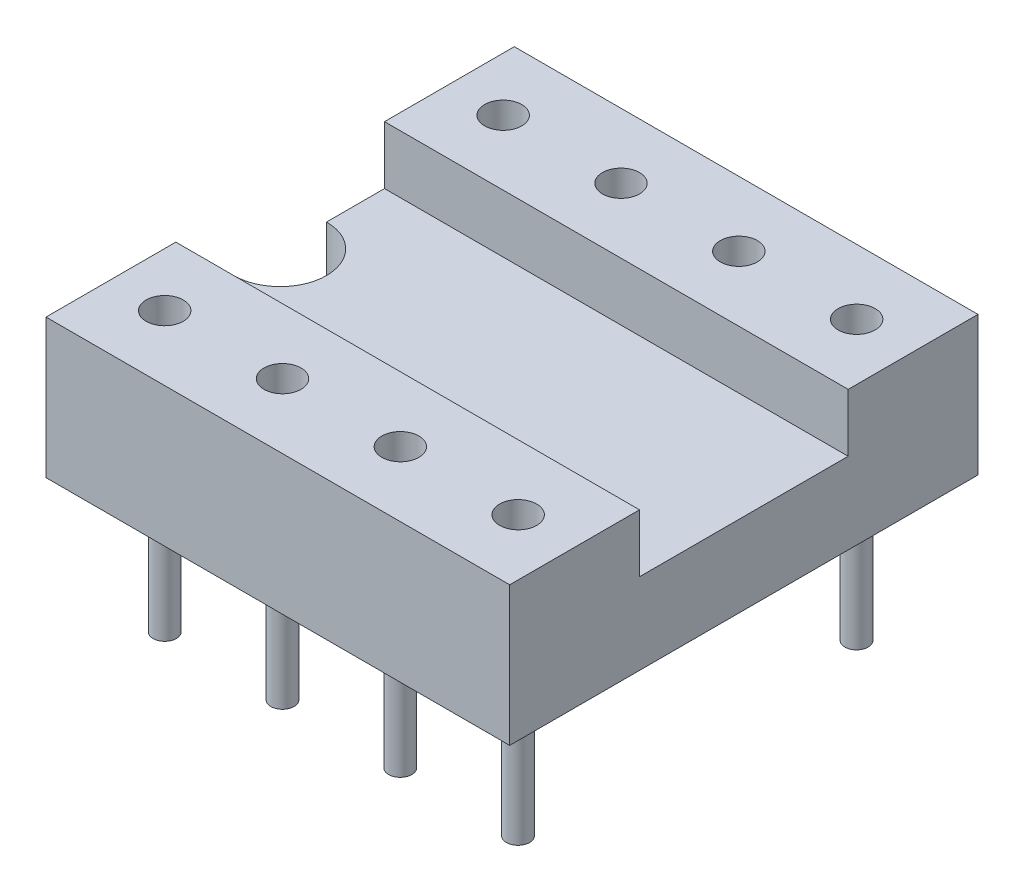
ISO-10303-21;
HEADER;
FILE_DESCRIPTION(('STEP AP214'),'2;1');
FILE_NAME('part.step','',(''),(''),'','','');
FILE_SCHEMA(('AUTOMOTIVE_DESIGN { 1 0 10303 214 1 1 1 1 }'));
ENDSEC;
DATA;
#1=APPLICATION_CONTEXT('core data for automotive mechanical design processes');
#2=APPLICATION_PROTOCOL_DEFINITION('international standard','automotive_design',2000,#1);
#3=PRODUCT_CONTEXT('',#1,'mechanical');
#4=PRODUCT('Part','Part','',(#3));
#5=PRODUCT_RELATED_PRODUCT_CATEGORY('part','',(#4));
#6=PRODUCT_DEFINITION_FORMATION('','',#4);
#7=PRODUCT_DEFINITION_CONTEXT('part definition',#1,'design');
#8=PRODUCT_DEFINITION('design','',#6,#7);
#9=PRODUCT_DEFINITION_SHAPE('','',#8);
#10=(LENGTH_UNIT() NAMED_UNIT(*) SI_UNIT(.MILLI.,.METRE.));
#11=(NAMED_UNIT(*) PLANE_ANGLE_UNIT() SI_UNIT($,.RADIAN.));
#12=(NAMED_UNIT(*) SI_UNIT($,.STERADIAN.) SOLID_ANGLE_UNIT());
#13=UNCERTAINTY_MEASURE_WITH_UNIT(LENGTH_MEASURE(1.E-05),#10,'distance_accuracy_value','');
#14=(GEOMETRIC_REPRESENTATION_CONTEXT(3) GLOBAL_UNCERTAINTY_ASSIGNED_CONTEXT((#13)) GLOBAL_UNIT_ASSIGNED_CONTEXT((#10,
#11,#12)) REPRESENTATION_CONTEXT('',''));
#15=CARTESIAN_POINT('',(0.,0.,0.));
#16=DIRECTION('',(0.,0.,1.));
#17=DIRECTION('',(1.,0.,0.));
#18=AXIS2_PLACEMENT_3D('',#15,#16,#17);
#19=CARTESIAN_POINT('',(10.,0.,5.05));
#20=DIRECTION('',(0.,1.,0.));
#21=DIRECTION('',(0.,0.,1.));
#22=AXIS2_PLACEMENT_3D('',#19,#20,#21);
#23=PLANE('',#22);
#24=CARTESIAN_POINT('',(8.78,0.,3.65));
#25=DIRECTION('',(0.,1.,0.));
#26=DIRECTION('',(0.,0.,1.));
#27=AXIS2_PLACEMENT_3D('',#24,#25,#26);
#28=CIRCLE('',#27,0.25);
#29=CARTESIAN_POINT('',(8.78,0.,3.9));
#30=VERTEX_POINT('',#29);
#31=EDGE_CURVE('E36',#30,#30,#28,.F.);
#32=ORIENTED_EDGE('',*,*,#31,.F.);
#33=EDGE_LOOP('',(#32));
#34=FACE_BOUND('',#33,.T.);
#35=CARTESIAN_POINT('',(6.24,0.,3.65));
#36=DIRECTION('',(0.,1.,0.));
#37=DIRECTION('',(0.,0.,1.));
#38=AXIS2_PLACEMENT_3D('',#35,#36,#37);
#39=CIRCLE('',#38,0.25);
#40=CARTESIAN_POINT('',(6.24,0.,3.9));
#41=VERTEX_POINT('',#40);
#42=EDGE_CURVE('E194',#41,#41,#39,.F.);
#43=ORIENTED_EDGE('',*,*,#42,.F.);
#44=EDGE_LOOP('',(#43));
#45=FACE_BOUND('',#44,.T.);
#46=CARTESIAN_POINT('',(3.7,0.,3.65));
#47=DIRECTION('',(0.,1.,0.));
#48=DIRECTION('',(0.,0.,1.));
#49=AXIS2_PLACEMENT_3D('',#46,#47,#48);
#50=CIRCLE('',#49,0.25);
#51=CARTESIAN_POINT('',(3.7,0.,3.9));
#52=VERTEX_POINT('',#51);
#53=EDGE_CURVE('E188',#52,#52,#50,.F.);
#54=ORIENTED_EDGE('',*,*,#53,.F.);
#55=EDGE_LOOP('',(#54));
#56=FACE_BOUND('',#55,.T.);
#57=CARTESIAN_POINT('',(1.16,0.,3.65));
#58=DIRECTION('',(0.,1.,0.));
#59=DIRECTION('',(0.,0.,1.));
#60=AXIS2_PLACEMENT_3D('',#57,#58,#59);
#61=CIRCLE('',#60,0.25);
#62=CARTESIAN_POINT('',(1.16,0.,3.9));
#63=VERTEX_POINT('',#62);
#64=EDGE_CURVE('E182',#63,#63,#61,.F.);
#65=ORIENTED_EDGE('',*,*,#64,.F.);
#66=EDGE_LOOP('',(#65));
#67=FACE_BOUND('',#66,.T.);
#68=DIRECTION('',(0.,0.,-1.));
#69=VECTOR('',#68,1.);
#70=CARTESIAN_POINT('',(0.,0.,5.05));
#71=LINE('',#70,#69);
#72=CARTESIAN_POINT('',(0.,0.,5.05));
#73=VERTEX_POINT('',#72);
#74=CARTESIAN_POINT('',(0.,0.,1.));
#75=VERTEX_POINT('',#74);
#76=EDGE_CURVE('E136',#73,#75,#71,.T.);
#77=ORIENTED_EDGE('',*,*,#76,.T.);
#78=CARTESIAN_POINT('',(0.,0.,0.));
#79=DIRECTION('',(0.,1.,0.));
#80=DIRECTION('',(0.,0.,1.));
#81=AXIS2_PLACEMENT_3D('',#78,#79,#80);
#82=CIRCLE('',#81,1.);
#83=CARTESIAN_POINT('',(0.,0.,-1.));
#84=VERTEX_POINT('',#83);
#85=EDGE_CURVE('E43',#75,#84,#82,.T.);
#86=ORIENTED_EDGE('',*,*,#85,.T.);
#87=CARTESIAN_POINT('',(0.,0.,-5.05));
#88=VERTEX_POINT('',#87);
#89=EDGE_CURVE('E121',#84,#88,#71,.T.);
#90=ORIENTED_EDGE('',*,*,#89,.T.);
#91=DIRECTION('',(-1.,0.,0.));
#92=VECTOR('',#91,1.);
#93=CARTESIAN_POINT('',(10.,0.,-5.05));
#94=LINE('',#93,#92);
#95=CARTESIAN_POINT('',(10.,0.,-5.05));
#96=VERTEX_POINT('',#95);
#97=EDGE_CURVE('E167',#96,#88,#94,.T.);
#98=ORIENTED_EDGE('',*,*,#97,.F.);
#99=DIRECTION('',(0.,0.,-1.));
#100=VECTOR('',#99,1.);
#101=CARTESIAN_POINT('',(10.,0.,5.05));
#102=LINE('',#101,#100);
#103=CARTESIAN_POINT('',(10.,0.,5.05));
#104=VERTEX_POINT('',#103);
#105=EDGE_CURVE('E153',#104,#96,#102,.T.);
#106=ORIENTED_EDGE('',*,*,#105,.F.);
#107=DIRECTION('',(-1.,0.,0.));
#108=VECTOR('',#107,1.);
#109=CARTESIAN_POINT('',(10.,0.,5.05));
#110=LINE('',#109,#108);
#111=EDGE_CURVE('E170',#104,#73,#110,.T.);
#112=ORIENTED_EDGE('',*,*,#111,.T.);
#113=EDGE_LOOP('',(#77,#86,#90,#98,#106,#112));
#114=FACE_BOUND('',#113,.T.);
#115=CARTESIAN_POINT('',(1.16,0.,-3.65));
#116=DIRECTION('',(0.,1.,0.));
#117=DIRECTION('',(0.,0.,1.));
#118=AXIS2_PLACEMENT_3D('',#115,#116,#117);
#119=CIRCLE('',#118,0.25);
#120=CARTESIAN_POINT('',(1.16,0.,-3.4));
#121=VERTEX_POINT('',#120);
#122=EDGE_CURVE('E185',#121,#121,#119,.F.);
#123=ORIENTED_EDGE('',*,*,#122,.F.);
#124=EDGE_LOOP('',(#123));
#125=FACE_BOUND('',#124,.T.);
#126=CARTESIAN_POINT('',(3.7,0.,-3.65));
#127=DIRECTION('',(0.,1.,0.));
#128=DIRECTION('',(0.,0.,1.));
#129=AXIS2_PLACEMENT_3D('',#126,#127,#128);
#130=CIRCLE('',#129,0.25);
#131=CARTESIAN_POINT('',(3.7,0.,-3.4));
#132=VERTEX_POINT('',#131);
#133=EDGE_CURVE('E191',#132,#132,#130,.F.);
#134=ORIENTED_EDGE('',*,*,#133,.F.);
#135=EDGE_LOOP('',(#134));
#136=FACE_BOUND('',#135,.T.);
#137=CARTESIAN_POINT('',(6.24,0.,-3.65));
#138=DIRECTION('',(0.,1.,0.));
#139=DIRECTION('',(0.,0.,1.));
#140=AXIS2_PLACEMENT_3D('',#137,#138,#139);
#141=CIRCLE('',#140,0.25);
#142=CARTESIAN_POINT('',(6.24,0.,-3.4));
#143=VERTEX_POINT('',#142);
#144=EDGE_CURVE('E197',#143,#143,#141,.F.);
#145=ORIENTED_EDGE('',*,*,#144,.F.);
#146=EDGE_LOOP('',(#145));
#147=FACE_BOUND('',#146,.T.);
#148=CARTESIAN_POINT('',(8.78,0.,-3.65));
#149=DIRECTION('',(0.,1.,0.));
#150=DIRECTION('',(0.,0.,1.));
#151=AXIS2_PLACEMENT_3D('',#148,#149,#150);
#152=CIRCLE('',#151,0.25);
#153=CARTESIAN_POINT('',(8.78,0.,-3.4));
#154=VERTEX_POINT('',#153);
#155=EDGE_CURVE('E11',#154,#154,#152,.F.);
#156=ORIENTED_EDGE('',*,*,#155,.F.);
#157=EDGE_LOOP('',(#156));
#158=FACE_BOUND('',#157,.T.);
#159=ADVANCED_FACE('F28',(#34,#45,#56,#67,#114,#125,#136,#147,#158),#23,.F.);
#160=CARTESIAN_POINT('',(0.,1.75,5.05));
#161=DIRECTION('',(1.,0.,0.));
#162=DIRECTION('',(0.,0.,-1.));
#163=AXIS2_PLACEMENT_3D('',#160,#161,#162);
#164=PLANE('',#163);
#165=ORIENTED_EDGE('',*,*,#89,.F.);
#166=DIRECTION('',(0.,1.,0.));
#167=VECTOR('',#166,1.);
#168=CARTESIAN_POINT('',(0.,0.,-1.));
#169=LINE('',#168,#167);
#170=CARTESIAN_POINT('',(0.,1.75,-1.));
#171=VERTEX_POINT('',#170);
#172=EDGE_CURVE('E107',#84,#171,#169,.T.);
#173=ORIENTED_EDGE('',*,*,#172,.T.);
#174=DIRECTION('',(0.,0.,1.));
#175=VECTOR('',#174,1.);
#176=CARTESIAN_POINT('',(0.,1.75,-2.25));
#177=LINE('',#176,#175);
#178=CARTESIAN_POINT('',(0.,1.75,-2.25));
#179=VERTEX_POINT('',#178);
#180=EDGE_CURVE('E119',#179,#171,#177,.T.);
#181=ORIENTED_EDGE('',*,*,#180,.F.);
#182=DIRECTION('',(0.,-1.,0.));
#183=VECTOR('',#182,1.);
#184=CARTESIAN_POINT('',(0.,3.,-2.25));
#185=LINE('',#184,#183);
#186=CARTESIAN_POINT('',(0.,3.,-2.25));
#187=VERTEX_POINT('',#186);
#188=EDGE_CURVE('E143',#187,#179,#185,.T.);
#189=ORIENTED_EDGE('',*,*,#188,.F.);
#190=DIRECTION('',(0.,0.,1.));
#191=VECTOR('',#190,1.);
#192=CARTESIAN_POINT('',(0.,3.,-5.05));
#193=LINE('',#192,#191);
#194=CARTESIAN_POINT('',(0.,3.,-5.05));
#195=VERTEX_POINT('',#194);
#196=EDGE_CURVE('E141',#195,#187,#193,.T.);
#197=ORIENTED_EDGE('',*,*,#196,.F.);
#198=DIRECTION('',(0.,1.,0.));
#199=VECTOR('',#198,1.);
#200=CARTESIAN_POINT('',(0.,0.,-5.05));
#201=LINE('',#200,#199);
#202=EDGE_CURVE('E139',#88,#195,#201,.T.);
#203=ORIENTED_EDGE('',*,*,#202,.F.);
#204=EDGE_LOOP('',(#165,#173,#181,#189,#197,#203));
#205=FACE_BOUND('',#204,.T.);
#206=ADVANCED_FACE('F117',(#205),#164,.F.);
#207=CARTESIAN_POINT('',(10.,1.75,-2.25));
#208=DIRECTION('',(0.,-1.,0.));
#209=DIRECTION('',(0.,0.,-1.));
#210=AXIS2_PLACEMENT_3D('',#207,#208,#209);
#211=PLANE('',#210);
#212=ORIENTED_EDGE('',*,*,#180,.T.);
#213=CARTESIAN_POINT('',(0.,1.75,0.));
#214=DIRECTION('',(0.,1.,0.));
#215=DIRECTION('',(0.,0.,1.));
#216=AXIS2_PLACEMENT_3D('',#213,#214,#215);
#217=CIRCLE('',#216,1.);
#218=CARTESIAN_POINT('',(0.,1.75,1.));
#219=VERTEX_POINT('',#218);
#220=EDGE_CURVE('E104',#219,#171,#217,.T.);
#221=ORIENTED_EDGE('',*,*,#220,.F.);
#222=CARTESIAN_POINT('',(0.,1.75,2.25));
#223=VERTEX_POINT('',#222);
#224=EDGE_CURVE('E127',#219,#223,#177,.T.);
#225=ORIENTED_EDGE('',*,*,#224,.T.);
#226=DIRECTION('',(-1.,0.,0.));
#227=VECTOR('',#226,1.);
#228=CARTESIAN_POINT('',(10.,1.75,2.25));
#229=LINE('',#228,#227);
#230=CARTESIAN_POINT('',(10.,1.75,2.25));
#231=VERTEX_POINT('',#230);
#232=EDGE_CURVE('E179',#231,#223,#229,.T.);
#233=ORIENTED_EDGE('',*,*,#232,.F.);
#234=DIRECTION('',(0.,0.,1.));
#235=VECTOR('',#234,1.);
#236=CARTESIAN_POINT('',(10.,1.75,-2.25));
#237=LINE('',#236,#235);
#238=CARTESIAN_POINT('',(10.,1.75,-2.25));
#239=VERTEX_POINT('',#238);
#240=EDGE_CURVE('E145',#239,#231,#237,.T.);
#241=ORIENTED_EDGE('',*,*,#240,.F.);
#242=DIRECTION('',(-1.,0.,0.));
#243=VECTOR('',#242,1.);
#244=CARTESIAN_POINT('',(10.,1.75,-2.25));
#245=LINE('',#244,#243);
#246=EDGE_CURVE('E125',#239,#179,#245,.T.);
#247=ORIENTED_EDGE('',*,*,#246,.T.);
#248=EDGE_LOOP('',(#212,#221,#225,#233,#241,#247));
#249=FACE_BOUND('',#248,.T.);
#250=ADVANCED_FACE('F30',(#249),#211,.F.);
#251=CARTESIAN_POINT('',(10.,1.75,2.25));
#252=DIRECTION('',(0.,0.,1.));
#253=DIRECTION('',(0.,-1.,0.));
#254=AXIS2_PLACEMENT_3D('',#251,#252,#253);
#255=PLANE('',#254);
#256=DIRECTION('',(0.,1.,0.));
#257=VECTOR('',#256,1.);
#258=CARTESIAN_POINT('',(0.,1.75,2.25));
#259=LINE('',#258,#257);
#260=CARTESIAN_POINT('',(0.,3.,2.25));
#261=VERTEX_POINT('',#260);
#262=EDGE_CURVE('E126',#223,#261,#259,.T.);
#263=ORIENTED_EDGE('',*,*,#262,.T.);
#264=DIRECTION('',(-1.,0.,0.));
#265=VECTOR('',#264,1.);
#266=CARTESIAN_POINT('',(10.,3.,2.25));
#267=LINE('',#266,#265);
#268=CARTESIAN_POINT('',(10.,3.,2.25));
#269=VERTEX_POINT('',#268);
#270=EDGE_CURVE('E176',#269,#261,#267,.T.);
#271=ORIENTED_EDGE('',*,*,#270,.F.);
#272=DIRECTION('',(0.,1.,0.));
#273=VECTOR('',#272,1.);
#274=CARTESIAN_POINT('',(10.,1.75,2.25));
#275=LINE('',#274,#273);
#276=EDGE_CURVE('E147',#231,#269,#275,.T.);
#277=ORIENTED_EDGE('',*,*,#276,.F.);
#278=ORIENTED_EDGE('',*,*,#232,.T.);
#279=EDGE_LOOP('',(#263,#271,#277,#278));
#280=FACE_BOUND('',#279,.T.);
#281=ADVANCED_FACE('F381',(#280),#255,.F.);
#282=CARTESIAN_POINT('',(10.,3.,2.25));
#283=DIRECTION('',(0.,-1.,0.));
#284=DIRECTION('',(0.,0.,-1.));
#285=AXIS2_PLACEMENT_3D('',#282,#283,#284);
#286=PLANE('',#285);
#287=CARTESIAN_POINT('',(8.783,3.,3.64999999999995));
#288=DIRECTION('',(0.,1.,0.));
#289=DIRECTION('',(0.,0.,1.));
#290=AXIS2_PLACEMENT_3D('',#287,#288,#289);
#291=CIRCLE('',#290,0.399999999999999);
#292=CARTESIAN_POINT('',(8.783,3.,4.04999999999995));
#293=VERTEX_POINT('',#292);
#294=EDGE_CURVE('E442',#293,#293,#291,.T.);
#295=ORIENTED_EDGE('',*,*,#294,.F.);
#296=EDGE_LOOP('',(#295));
#297=FACE_BOUND('',#296,.T.);
#298=CARTESIAN_POINT('',(6.242,3.,3.64999999999996));
#299=DIRECTION('',(0.,1.,0.));
#300=DIRECTION('',(0.,0.,1.));
#301=AXIS2_PLACEMENT_3D('',#298,#299,#300);
#302=CIRCLE('',#301,0.4);
#303=CARTESIAN_POINT('',(6.242,3.,4.04999999999996));
#304=VERTEX_POINT('',#303);
#305=EDGE_CURVE('E430',#304,#304,#302,.T.);
#306=ORIENTED_EDGE('',*,*,#305,.F.);
#307=EDGE_LOOP('',(#306));
#308=FACE_BOUND('',#307,.T.);
#309=CARTESIAN_POINT('',(3.701,3.,3.64999999999998));
#310=DIRECTION('',(0.,1.,0.));
#311=DIRECTION('',(0.,0.,1.));
#312=AXIS2_PLACEMENT_3D('',#309,#310,#311);
#313=CIRCLE('',#312,0.4);
#314=CARTESIAN_POINT('',(3.701,3.,4.04999999999998));
#315=VERTEX_POINT('',#314);
#316=EDGE_CURVE('E418',#315,#315,#313,.T.);
#317=ORIENTED_EDGE('',*,*,#316,.F.);
#318=EDGE_LOOP('',(#317));
#319=FACE_BOUND('',#318,.T.);
#320=CARTESIAN_POINT('',(1.16,3.,3.65));
#321=DIRECTION('',(0.,1.,0.));
#322=DIRECTION('',(0.,0.,1.));
#323=AXIS2_PLACEMENT_3D('',#320,#321,#322);
#324=CIRCLE('',#323,0.4);
#325=CARTESIAN_POINT('',(1.16,3.,4.05));
#326=VERTEX_POINT('',#325);
#327=EDGE_CURVE('E406',#326,#326,#324,.T.);
#328=ORIENTED_EDGE('',*,*,#327,.F.);
#329=EDGE_LOOP('',(#328));
#330=FACE_BOUND('',#329,.T.);
#331=DIRECTION('',(0.,0.,1.));
#332=VECTOR('',#331,1.);
#333=CARTESIAN_POINT('',(0.,3.,2.25));
#334=LINE('',#333,#332);
#335=CARTESIAN_POINT('',(0.,3.,5.05));
#336=VERTEX_POINT('',#335);
#337=EDGE_CURVE('E129',#261,#336,#334,.T.);
#338=ORIENTED_EDGE('',*,*,#337,.T.);
#339=DIRECTION('',(-1.,0.,0.));
#340=VECTOR('',#339,1.);
#341=CARTESIAN_POINT('',(10.,3.,5.05));
#342=LINE('',#341,#340);
#343=CARTESIAN_POINT('',(10.,3.,5.05));
#344=VERTEX_POINT('',#343);
#345=EDGE_CURVE('E173',#344,#336,#342,.T.);
#346=ORIENTED_EDGE('',*,*,#345,.F.);
#347=DIRECTION('',(0.,0.,1.));
#348=VECTOR('',#347,1.);
#349=CARTESIAN_POINT('',(10.,3.,2.25));
#350=LINE('',#349,#348);
#351=EDGE_CURVE('E149',#269,#344,#350,.T.);
#352=ORIENTED_EDGE('',*,*,#351,.F.);
#353=ORIENTED_EDGE('',*,*,#270,.T.);
#354=EDGE_LOOP('',(#338,#346,#352,#353));
#355=FACE_BOUND('',#354,.T.);
#356=ADVANCED_FACE('F378',(#297,#308,#319,#330,#355),#286,.F.);
#357=CARTESIAN_POINT('',(10.,3.,5.05));
#358=DIRECTION('',(0.,0.,-1.));
#359=DIRECTION('',(-1.,0.,0.));
#360=AXIS2_PLACEMENT_3D('',#357,#358,#359);
#361=PLANE('',#360);
#362=DIRECTION('',(0.,-1.,0.));
#363=VECTOR('',#362,1.);
#364=CARTESIAN_POINT('',(0.,3.,5.05));
#365=LINE('',#364,#363);
#366=EDGE_CURVE('E134',#336,#73,#365,.T.);
#367=ORIENTED_EDGE('',*,*,#366,.T.);
#368=ORIENTED_EDGE('',*,*,#111,.F.);
#369=DIRECTION('',(0.,-1.,0.));
#370=VECTOR('',#369,1.);
#371=CARTESIAN_POINT('',(10.,3.,5.05));
#372=LINE('',#371,#370);
#373=EDGE_CURVE('E151',#344,#104,#372,.T.);
#374=ORIENTED_EDGE('',*,*,#373,.F.);
#375=ORIENTED_EDGE('',*,*,#345,.T.);
#376=EDGE_LOOP('',(#367,#368,#374,#375));
#377=FACE_BOUND('',#376,.T.);
#378=ADVANCED_FACE('F373',(#377),#361,.F.);
#379=CARTESIAN_POINT('',(10.,0.,-5.05));
#380=DIRECTION('',(0.,0.,1.));
#381=DIRECTION('',(0.,-1.,0.));
#382=AXIS2_PLACEMENT_3D('',#379,#380,#381);
#383=PLANE('',#382);
#384=ORIENTED_EDGE('',*,*,#202,.T.);
#385=DIRECTION('',(-1.,0.,0.));
#386=VECTOR('',#385,1.);
#387=CARTESIAN_POINT('',(10.,3.,-5.05));
#388=LINE('',#387,#386);
#389=CARTESIAN_POINT('',(10.,3.,-5.05));
#390=VERTEX_POINT('',#389);
#391=EDGE_CURVE('E164',#390,#195,#388,.T.);
#392=ORIENTED_EDGE('',*,*,#391,.F.);
#393=DIRECTION('',(0.,1.,0.));
#394=VECTOR('',#393,1.);
#395=CARTESIAN_POINT('',(10.,0.,-5.05));
#396=LINE('',#395,#394);
#397=EDGE_CURVE('E155',#96,#390,#396,.T.);
#398=ORIENTED_EDGE('',*,*,#397,.F.);
#399=ORIENTED_EDGE('',*,*,#97,.T.);
#400=EDGE_LOOP('',(#384,#392,#398,#399));
#401=FACE_BOUND('',#400,.T.);
#402=ADVANCED_FACE('F370',(#401),#383,.F.);
#403=CARTESIAN_POINT('',(10.,3.,-5.05));
#404=DIRECTION('',(0.,-1.,0.));
#405=DIRECTION('',(0.,0.,-1.));
#406=AXIS2_PLACEMENT_3D('',#403,#404,#405);
#407=PLANE('',#406);
#408=CARTESIAN_POINT('',(8.783,3.,-3.65000000000005));
#409=DIRECTION('',(0.,1.,0.));
#410=DIRECTION('',(0.,0.,-1.));
#411=AXIS2_PLACEMENT_3D('',#408,#409,#410);
#412=CIRCLE('',#411,0.399999999999999);
#413=CARTESIAN_POINT('',(8.783,3.,-4.05000000000005));
#414=VERTEX_POINT('',#413);
#415=EDGE_CURVE('E448',#414,#414,#412,.T.);
#416=ORIENTED_EDGE('',*,*,#415,.F.);
#417=EDGE_LOOP('',(#416));
#418=FACE_BOUND('',#417,.T.);
#419=CARTESIAN_POINT('',(6.242,3.,-3.65000000000003));
#420=DIRECTION('',(0.,1.,0.));
#421=DIRECTION('',(0.,0.,-1.));
#422=AXIS2_PLACEMENT_3D('',#419,#420,#421);
#423=CIRCLE('',#422,0.4);
#424=CARTESIAN_POINT('',(6.242,3.,-4.05000000000004));
#425=VERTEX_POINT('',#424);
#426=EDGE_CURVE('E436',#425,#425,#423,.T.);
#427=ORIENTED_EDGE('',*,*,#426,.F.);
#428=EDGE_LOOP('',(#427));
#429=FACE_BOUND('',#428,.T.);
#430=CARTESIAN_POINT('',(3.701,3.,-3.65000000000002));
#431=DIRECTION('',(0.,1.,0.));
#432=DIRECTION('',(0.,0.,-1.));
#433=AXIS2_PLACEMENT_3D('',#430,#431,#432);
#434=CIRCLE('',#433,0.4);
#435=CARTESIAN_POINT('',(3.701,3.,-4.05000000000002));
#436=VERTEX_POINT('',#435);
#437=EDGE_CURVE('E424',#436,#436,#434,.T.);
#438=ORIENTED_EDGE('',*,*,#437,.F.);
#439=EDGE_LOOP('',(#438));
#440=FACE_BOUND('',#439,.T.);
#441=CARTESIAN_POINT('',(1.16,3.,-3.65));
#442=DIRECTION('',(0.,1.,0.));
#443=DIRECTION('',(0.,0.,-1.));
#444=AXIS2_PLACEMENT_3D('',#441,#442,#443);
#445=CIRCLE('',#444,0.4);
#446=CARTESIAN_POINT('',(1.16,3.,-4.05));
#447=VERTEX_POINT('',#446);
#448=EDGE_CURVE('E412',#447,#447,#445,.T.);
#449=ORIENTED_EDGE('',*,*,#448,.F.);
#450=EDGE_LOOP('',(#449));
#451=FACE_BOUND('',#450,.T.);
#452=ORIENTED_EDGE('',*,*,#196,.T.);
#453=DIRECTION('',(-1.,0.,0.));
#454=VECTOR('',#453,1.);
#455=CARTESIAN_POINT('',(10.,3.,-2.25));
#456=LINE('',#455,#454);
#457=CARTESIAN_POINT('',(10.,3.,-2.25));
#458=VERTEX_POINT('',#457);
#459=EDGE_CURVE('E161',#458,#187,#456,.T.);
#460=ORIENTED_EDGE('',*,*,#459,.F.);
#461=DIRECTION('',(0.,0.,1.));
#462=VECTOR('',#461,1.);
#463=CARTESIAN_POINT('',(10.,3.,-5.05));
#464=LINE('',#463,#462);
#465=EDGE_CURVE('E157',#390,#458,#464,.T.);
#466=ORIENTED_EDGE('',*,*,#465,.F.);
#467=ORIENTED_EDGE('',*,*,#391,.T.);
#468=EDGE_LOOP('',(#452,#460,#466,#467));
#469=FACE_BOUND('',#468,.T.);
#470=ADVANCED_FACE('F366',(#418,#429,#440,#451,#469),#407,.F.);
#471=CARTESIAN_POINT('',(10.,3.,-2.25));
#472=DIRECTION('',(0.,0.,-1.));
#473=DIRECTION('',(0.,1.,0.));
#474=AXIS2_PLACEMENT_3D('',#471,#472,#473);
#475=PLANE('',#474);
#476=ORIENTED_EDGE('',*,*,#188,.T.);
#477=ORIENTED_EDGE('',*,*,#246,.F.);
#478=DIRECTION('',(0.,-1.,0.));
#479=VECTOR('',#478,1.);
#480=CARTESIAN_POINT('',(10.,3.,-2.25));
#481=LINE('',#480,#479);
#482=EDGE_CURVE('E51',#458,#239,#481,.T.);
#483=ORIENTED_EDGE('',*,*,#482,.F.);
#484=ORIENTED_EDGE('',*,*,#459,.T.);
#485=EDGE_LOOP('',(#476,#477,#483,#484));
#486=FACE_BOUND('',#485,.T.);
#487=ADVANCED_FACE('F363',(#486),#475,.F.);
#488=CARTESIAN_POINT('',(10.,1.75,5.05));
#489=DIRECTION('',(1.,0.,0.));
#490=DIRECTION('',(0.,0.,-1.));
#491=AXIS2_PLACEMENT_3D('',#488,#489,#490);
#492=PLANE('',#491);
#493=ORIENTED_EDGE('',*,*,#240,.T.);
#494=ORIENTED_EDGE('',*,*,#276,.T.);
#495=ORIENTED_EDGE('',*,*,#351,.T.);
#496=ORIENTED_EDGE('',*,*,#373,.T.);
#497=ORIENTED_EDGE('',*,*,#105,.T.);
#498=ORIENTED_EDGE('',*,*,#397,.T.);
#499=ORIENTED_EDGE('',*,*,#465,.T.);
#500=ORIENTED_EDGE('',*,*,#482,.T.);
#501=EDGE_LOOP('',(#493,#494,#495,#496,#497,#498,#499,#500));
#502=FACE_BOUND('',#501,.T.);
#503=ADVANCED_FACE('F359',(#502),#492,.T.);
#504=ORIENTED_EDGE('',*,*,#224,.F.);
#505=DIRECTION('',(0.,1.,0.));
#506=VECTOR('',#505,1.);
#507=CARTESIAN_POINT('',(0.,0.,1.));
#508=LINE('',#507,#506);
#509=EDGE_CURVE('E108',#75,#219,#508,.T.);
#510=ORIENTED_EDGE('',*,*,#509,.F.);
#511=ORIENTED_EDGE('',*,*,#76,.F.);
#512=ORIENTED_EDGE('',*,*,#366,.F.);
#513=ORIENTED_EDGE('',*,*,#337,.F.);
#514=ORIENTED_EDGE('',*,*,#262,.F.);
#515=EDGE_LOOP('',(#504,#510,#511,#512,#513,#514));
#516=FACE_BOUND('',#515,.T.);
#517=ADVANCED_FACE('F356',(#516),#164,.F.);
#518=CARTESIAN_POINT('',(0.,0.,0.));
#519=DIRECTION('',(0.,1.,0.));
#520=DIRECTION('',(0.,0.,1.));
#521=AXIS2_PLACEMENT_3D('',#518,#519,#520);
#522=CYLINDRICAL_SURFACE('',#521,1.);
#523=ORIENTED_EDGE('',*,*,#220,.T.);
#524=ORIENTED_EDGE('',*,*,#172,.F.);
#525=ORIENTED_EDGE('',*,*,#85,.F.);
#526=ORIENTED_EDGE('',*,*,#509,.T.);
#527=EDGE_LOOP('',(#523,#524,#525,#526));
#528=FACE_BOUND('',#527,.T.);
#529=ADVANCED_FACE('F106',(#528),#522,.F.);
#530=CARTESIAN_POINT('',(1.16,0.5,3.65));
#531=DIRECTION('',(0.,1.,0.));
#532=DIRECTION('',(0.,0.,1.));
#533=AXIS2_PLACEMENT_3D('',#530,#531,#532);
#534=CYLINDRICAL_SURFACE('',#533,0.4);
#535=CARTESIAN_POINT('',(1.16,0.5,3.65));
#536=DIRECTION('',(0.,1.,0.));
#537=DIRECTION('',(0.,0.,1.));
#538=AXIS2_PLACEMENT_3D('',#535,#536,#537);
#539=CIRCLE('',#538,0.4);
#540=CARTESIAN_POINT('',(1.16,0.5,4.05));
#541=VERTEX_POINT('',#540);
#542=EDGE_CURVE('E112',#541,#541,#539,.T.);
#543=ORIENTED_EDGE('',*,*,#542,.F.);
#544=EDGE_LOOP('',(#543));
#545=FACE_BOUND('',#544,.T.);
#546=ORIENTED_EDGE('',*,*,#327,.T.);
#547=EDGE_LOOP('',(#546));
#548=FACE_BOUND('',#547,.T.);
#549=ADVANCED_FACE('F349',(#545,#548),#534,.F.);
#550=CARTESIAN_POINT('',(1.16,0.5,3.65));
#551=DIRECTION('',(0.,1.,0.));
#552=DIRECTION('',(0.,0.,1.));
#553=AXIS2_PLACEMENT_3D('',#550,#551,#552);
#554=PLANE('',#553);
#555=ORIENTED_EDGE('',*,*,#542,.T.);
#556=EDGE_LOOP('',(#555));
#557=FACE_BOUND('',#556,.T.);
#558=ADVANCED_FACE('F345',(#557),#554,.T.);
#559=CARTESIAN_POINT('',(1.16,0.5,-3.65));
#560=DIRECTION('',(0.,1.,0.));
#561=DIRECTION('',(0.,0.,1.));
#562=AXIS2_PLACEMENT_3D('',#559,#560,#561);
#563=CYLINDRICAL_SURFACE('',#562,0.4);
#564=CARTESIAN_POINT('',(1.16,0.5,-3.65));
#565=DIRECTION('',(0.,1.,0.));
#566=DIRECTION('',(0.,0.,-1.));
#567=AXIS2_PLACEMENT_3D('',#564,#565,#566);
#568=CIRCLE('',#567,0.4);
#569=CARTESIAN_POINT('',(1.16,0.5,-4.05));
#570=VERTEX_POINT('',#569);
#571=EDGE_CURVE('E409',#570,#570,#568,.T.);
#572=ORIENTED_EDGE('',*,*,#571,.F.);
#573=EDGE_LOOP('',(#572));
#574=FACE_BOUND('',#573,.T.);
#575=ORIENTED_EDGE('',*,*,#448,.T.);
#576=EDGE_LOOP('',(#575));
#577=FACE_BOUND('',#576,.T.);
#578=ADVANCED_FACE('F341',(#574,#577),#563,.F.);
#579=CARTESIAN_POINT('',(1.16,0.5,-3.65));
#580=DIRECTION('',(0.,-1.,0.));
#581=DIRECTION('',(0.,0.,-1.));
#582=AXIS2_PLACEMENT_3D('',#579,#580,#581);
#583=PLANE('',#582);
#584=ORIENTED_EDGE('',*,*,#571,.T.);
#585=EDGE_LOOP('',(#584));
#586=FACE_BOUND('',#585,.T.);
#587=ADVANCED_FACE('F337',(#586),#583,.F.);
#588=CARTESIAN_POINT('',(3.701,0.5,3.64999999999998));
#589=DIRECTION('',(0.,1.,0.));
#590=DIRECTION('',(0.,0.,1.));
#591=AXIS2_PLACEMENT_3D('',#588,#589,#590);
#592=CYLINDRICAL_SURFACE('',#591,0.4);
#593=CARTESIAN_POINT('',(3.701,0.5,3.64999999999998));
#594=DIRECTION('',(0.,1.,0.));
#595=DIRECTION('',(0.,0.,1.));
#596=AXIS2_PLACEMENT_3D('',#593,#594,#595);
#597=CIRCLE('',#596,0.4);
#598=CARTESIAN_POINT('',(3.701,0.5,4.04999999999998));
#599=VERTEX_POINT('',#598);
#600=EDGE_CURVE('E415',#599,#599,#597,.T.);
#601=ORIENTED_EDGE('',*,*,#600,.F.);
#602=EDGE_LOOP('',(#601));
#603=FACE_BOUND('',#602,.T.);
#604=ORIENTED_EDGE('',*,*,#316,.T.);
#605=EDGE_LOOP('',(#604));
#606=FACE_BOUND('',#605,.T.);
#607=ADVANCED_FACE('F333',(#603,#606),#592,.F.);
#608=CARTESIAN_POINT('',(3.701,0.5,3.64999999999998));
#609=DIRECTION('',(0.,1.,0.));
#610=DIRECTION('',(0.,0.,1.));
#611=AXIS2_PLACEMENT_3D('',#608,#609,#610);
#612=PLANE('',#611);
#613=ORIENTED_EDGE('',*,*,#600,.T.);
#614=EDGE_LOOP('',(#613));
#615=FACE_BOUND('',#614,.T.);
#616=ADVANCED_FACE('F329',(#615),#612,.T.);
#617=CARTESIAN_POINT('',(3.701,0.5,-3.65000000000002));
#618=DIRECTION('',(0.,1.,0.));
#619=DIRECTION('',(0.,0.,1.));
#620=AXIS2_PLACEMENT_3D('',#617,#618,#619);
#621=CYLINDRICAL_SURFACE('',#620,0.4);
#622=CARTESIAN_POINT('',(3.701,0.5,-3.65000000000002));
#623=DIRECTION('',(0.,1.,0.));
#624=DIRECTION('',(0.,0.,-1.));
#625=AXIS2_PLACEMENT_3D('',#622,#623,#624);
#626=CIRCLE('',#625,0.4);
#627=CARTESIAN_POINT('',(3.701,0.5,-4.05000000000002));
#628=VERTEX_POINT('',#627);
#629=EDGE_CURVE('E421',#628,#628,#626,.T.);
#630=ORIENTED_EDGE('',*,*,#629,.F.);
#631=EDGE_LOOP('',(#630));
#632=FACE_BOUND('',#631,.T.);
#633=ORIENTED_EDGE('',*,*,#437,.T.);
#634=EDGE_LOOP('',(#633));
#635=FACE_BOUND('',#634,.T.);
#636=ADVANCED_FACE('F325',(#632,#635),#621,.F.);
#637=CARTESIAN_POINT('',(3.701,0.5,-3.65000000000002));
#638=DIRECTION('',(0.,-1.,0.));
#639=DIRECTION('',(0.,0.,-1.));
#640=AXIS2_PLACEMENT_3D('',#637,#638,#639);
#641=PLANE('',#640);
#642=ORIENTED_EDGE('',*,*,#629,.T.);
#643=EDGE_LOOP('',(#642));
#644=FACE_BOUND('',#643,.T.);
#645=ADVANCED_FACE('F321',(#644),#641,.F.);
#646=CARTESIAN_POINT('',(6.242,0.5,3.64999999999996));
#647=DIRECTION('',(0.,1.,0.));
#648=DIRECTION('',(0.,0.,1.));
#649=AXIS2_PLACEMENT_3D('',#646,#647,#648);
#650=CYLINDRICAL_SURFACE('',#649,0.4);
#651=CARTESIAN_POINT('',(6.242,0.5,3.64999999999996));
#652=DIRECTION('',(0.,1.,0.));
#653=DIRECTION('',(0.,0.,1.));
#654=AXIS2_PLACEMENT_3D('',#651,#652,#653);
#655=CIRCLE('',#654,0.4);
#656=CARTESIAN_POINT('',(6.242,0.5,4.04999999999996));
#657=VERTEX_POINT('',#656);
#658=EDGE_CURVE('E427',#657,#657,#655,.T.);
#659=ORIENTED_EDGE('',*,*,#658,.F.);
#660=EDGE_LOOP('',(#659));
#661=FACE_BOUND('',#660,.T.);
#662=ORIENTED_EDGE('',*,*,#305,.T.);
#663=EDGE_LOOP('',(#662));
#664=FACE_BOUND('',#663,.T.);
#665=ADVANCED_FACE('F317',(#661,#664),#650,.F.);
#666=CARTESIAN_POINT('',(6.242,0.5,3.64999999999996));
#667=DIRECTION('',(0.,1.,0.));
#668=DIRECTION('',(0.,0.,1.));
#669=AXIS2_PLACEMENT_3D('',#666,#667,#668);
#670=PLANE('',#669);
#671=ORIENTED_EDGE('',*,*,#658,.T.);
#672=EDGE_LOOP('',(#671));
#673=FACE_BOUND('',#672,.T.);
#674=ADVANCED_FACE('F313',(#673),#670,.T.);
#675=CARTESIAN_POINT('',(6.242,0.5,-3.65000000000003));
#676=DIRECTION('',(0.,1.,0.));
#677=DIRECTION('',(0.,0.,1.));
#678=AXIS2_PLACEMENT_3D('',#675,#676,#677);
#679=CYLINDRICAL_SURFACE('',#678,0.4);
#680=CARTESIAN_POINT('',(6.242,0.5,-3.65000000000003));
#681=DIRECTION('',(0.,1.,0.));
#682=DIRECTION('',(0.,0.,-1.));
#683=AXIS2_PLACEMENT_3D('',#680,#681,#682);
#684=CIRCLE('',#683,0.4);
#685=CARTESIAN_POINT('',(6.242,0.5,-4.05000000000004));
#686=VERTEX_POINT('',#685);
#687=EDGE_CURVE('E433',#686,#686,#684,.T.);
#688=ORIENTED_EDGE('',*,*,#687,.F.);
#689=EDGE_LOOP('',(#688));
#690=FACE_BOUND('',#689,.T.);
#691=ORIENTED_EDGE('',*,*,#426,.T.);
#692=EDGE_LOOP('',(#691));
#693=FACE_BOUND('',#692,.T.);
#694=ADVANCED_FACE('F309',(#690,#693),#679,.F.);
#695=CARTESIAN_POINT('',(6.242,0.5,-3.65000000000003));
#696=DIRECTION('',(0.,-1.,0.));
#697=DIRECTION('',(0.,0.,-1.));
#698=AXIS2_PLACEMENT_3D('',#695,#696,#697);
#699=PLANE('',#698);
#700=ORIENTED_EDGE('',*,*,#687,.T.);
#701=EDGE_LOOP('',(#700));
#702=FACE_BOUND('',#701,.T.);
#703=ADVANCED_FACE('F305',(#702),#699,.F.);
#704=CARTESIAN_POINT('',(8.783,0.5,3.64999999999995));
#705=DIRECTION('',(0.,1.,0.));
#706=DIRECTION('',(0.,0.,1.));
#707=AXIS2_PLACEMENT_3D('',#704,#705,#706);
#708=CYLINDRICAL_SURFACE('',#707,0.399999999999999);
#709=CARTESIAN_POINT('',(8.783,0.5,3.64999999999995));
#710=DIRECTION('',(0.,1.,0.));
#711=DIRECTION('',(0.,0.,1.));
#712=AXIS2_PLACEMENT_3D('',#709,#710,#711);
#713=CIRCLE('',#712,0.399999999999999);
#714=CARTESIAN_POINT('',(8.783,0.5,4.04999999999995));
#715=VERTEX_POINT('',#714);
#716=EDGE_CURVE('E439',#715,#715,#713,.T.);
#717=ORIENTED_EDGE('',*,*,#716,.F.);
#718=EDGE_LOOP('',(#717));
#719=FACE_BOUND('',#718,.T.);
#720=ORIENTED_EDGE('',*,*,#294,.T.);
#721=EDGE_LOOP('',(#720));
#722=FACE_BOUND('',#721,.T.);
#723=ADVANCED_FACE('F301',(#719,#722),#708,.F.);
#724=CARTESIAN_POINT('',(8.783,0.5,3.64999999999995));
#725=DIRECTION('',(0.,1.,0.));
#726=DIRECTION('',(0.,0.,1.));
#727=AXIS2_PLACEMENT_3D('',#724,#725,#726);
#728=PLANE('',#727);
#729=ORIENTED_EDGE('',*,*,#716,.T.);
#730=EDGE_LOOP('',(#729));
#731=FACE_BOUND('',#730,.T.);
#732=ADVANCED_FACE('F297',(#731),#728,.T.);
#733=CARTESIAN_POINT('',(8.783,0.5,-3.65000000000005));
#734=DIRECTION('',(0.,1.,0.));
#735=DIRECTION('',(0.,0.,1.));
#736=AXIS2_PLACEMENT_3D('',#733,#734,#735);
#737=CYLINDRICAL_SURFACE('',#736,0.399999999999999);
#738=CARTESIAN_POINT('',(8.783,0.5,-3.65000000000005));
#739=DIRECTION('',(0.,1.,0.));
#740=DIRECTION('',(0.,0.,-1.));
#741=AXIS2_PLACEMENT_3D('',#738,#739,#740);
#742=CIRCLE('',#741,0.399999999999999);
#743=CARTESIAN_POINT('',(8.783,0.5,-4.05000000000005));
#744=VERTEX_POINT('',#743);
#745=EDGE_CURVE('E445',#744,#744,#742,.T.);
#746=ORIENTED_EDGE('',*,*,#745,.F.);
#747=EDGE_LOOP('',(#746));
#748=FACE_BOUND('',#747,.T.);
#749=ORIENTED_EDGE('',*,*,#415,.T.);
#750=EDGE_LOOP('',(#749));
#751=FACE_BOUND('',#750,.T.);
#752=ADVANCED_FACE('F293',(#748,#751),#737,.F.);
#753=CARTESIAN_POINT('',(8.783,0.5,-3.65000000000005));
#754=DIRECTION('',(0.,-1.,0.));
#755=DIRECTION('',(0.,0.,-1.));
#756=AXIS2_PLACEMENT_3D('',#753,#754,#755);
#757=PLANE('',#756);
#758=ORIENTED_EDGE('',*,*,#745,.T.);
#759=EDGE_LOOP('',(#758));
#760=FACE_BOUND('',#759,.T.);
#761=ADVANCED_FACE('F289',(#760),#757,.F.);
#762=CARTESIAN_POINT('',(1.16,-3.,3.65));
#763=DIRECTION('',(0.,1.,0.));
#764=DIRECTION('',(0.,0.,1.));
#765=AXIS2_PLACEMENT_3D('',#762,#763,#764);
#766=CYLINDRICAL_SURFACE('',#765,0.25);
#767=CARTESIAN_POINT('',(1.16,-3.,3.65));
#768=DIRECTION('',(0.,-1.,0.));
#769=DIRECTION('',(0.,0.,-1.));
#770=AXIS2_PLACEMENT_3D('',#767,#768,#769);
#771=CIRCLE('',#770,0.25);
#772=CARTESIAN_POINT('',(1.16,-3.,3.4));
#773=VERTEX_POINT('',#772);
#774=EDGE_CURVE('E451',#773,#773,#771,.T.);
#775=ORIENTED_EDGE('',*,*,#774,.F.);
#776=EDGE_LOOP('',(#775));
#777=FACE_BOUND('',#776,.T.);
#778=ORIENTED_EDGE('',*,*,#64,.T.);
#779=EDGE_LOOP('',(#778));
#780=FACE_BOUND('',#779,.T.);
#781=ADVANCED_FACE('F285',(#777,#780),#766,.T.);
#782=CARTESIAN_POINT('',(1.16,-3.,3.65));
#783=DIRECTION('',(0.,-1.,0.));
#784=DIRECTION('',(0.,0.,-1.));
#785=AXIS2_PLACEMENT_3D('',#782,#783,#784);
#786=PLANE('',#785);
#787=ORIENTED_EDGE('',*,*,#774,.T.);
#788=EDGE_LOOP('',(#787));
#789=FACE_BOUND('',#788,.T.);
#790=ADVANCED_FACE('F281',(#789),#786,.T.);
#791=CARTESIAN_POINT('',(1.16,-3.,-3.65));
#792=DIRECTION('',(0.,1.,0.));
#793=DIRECTION('',(0.,0.,1.));
#794=AXIS2_PLACEMENT_3D('',#791,#792,#793);
#795=CYLINDRICAL_SURFACE('',#794,0.25);
#796=CARTESIAN_POINT('',(1.16,-3.,-3.65));
#797=DIRECTION('',(0.,-1.,0.));
#798=DIRECTION('',(0.,0.,1.));
#799=AXIS2_PLACEMENT_3D('',#796,#797,#798);
#800=CIRCLE('',#799,0.25);
#801=CARTESIAN_POINT('',(1.16,-3.,-3.4));
#802=VERTEX_POINT('',#801);
#803=EDGE_CURVE('E454',#802,#802,#800,.T.);
#804=ORIENTED_EDGE('',*,*,#803,.F.);
#805=EDGE_LOOP('',(#804));
#806=FACE_BOUND('',#805,.T.);
#807=ORIENTED_EDGE('',*,*,#122,.T.);
#808=EDGE_LOOP('',(#807));
#809=FACE_BOUND('',#808,.T.);
#810=ADVANCED_FACE('F277',(#806,#809),#795,.T.);
#811=CARTESIAN_POINT('',(1.16,-3.,-3.65));
#812=DIRECTION('',(0.,1.,0.));
#813=DIRECTION('',(0.,0.,1.));
#814=AXIS2_PLACEMENT_3D('',#811,#812,#813);
#815=PLANE('',#814);
#816=ORIENTED_EDGE('',*,*,#803,.T.);
#817=EDGE_LOOP('',(#816));
#818=FACE_BOUND('',#817,.T.);
#819=ADVANCED_FACE('F273',(#818),#815,.F.);
#820=CARTESIAN_POINT('',(3.7,-3.,3.65));
#821=DIRECTION('',(0.,1.,0.));
#822=DIRECTION('',(0.,0.,1.));
#823=AXIS2_PLACEMENT_3D('',#820,#821,#822);
#824=CYLINDRICAL_SURFACE('',#823,0.25);
#825=CARTESIAN_POINT('',(3.7,-3.,3.65));
#826=DIRECTION('',(0.,-1.,0.));
#827=DIRECTION('',(0.,0.,-1.));
#828=AXIS2_PLACEMENT_3D('',#825,#826,#827);
#829=CIRCLE('',#828,0.25);
#830=CARTESIAN_POINT('',(3.7,-3.,3.4));
#831=VERTEX_POINT('',#830);
#832=EDGE_CURVE('E457',#831,#831,#829,.T.);
#833=ORIENTED_EDGE('',*,*,#832,.F.);
#834=EDGE_LOOP('',(#833));
#835=FACE_BOUND('',#834,.T.);
#836=ORIENTED_EDGE('',*,*,#53,.T.);
#837=EDGE_LOOP('',(#836));
#838=FACE_BOUND('',#837,.T.);
#839=ADVANCED_FACE('F269',(#835,#838),#824,.T.);
#840=CARTESIAN_POINT('',(3.7,-3.,3.65));
#841=DIRECTION('',(0.,-1.,0.));
#842=DIRECTION('',(0.,0.,-1.));
#843=AXIS2_PLACEMENT_3D('',#840,#841,#842);
#844=PLANE('',#843);
#845=ORIENTED_EDGE('',*,*,#832,.T.);
#846=EDGE_LOOP('',(#845));
#847=FACE_BOUND('',#846,.T.);
#848=ADVANCED_FACE('F265',(#847),#844,.T.);
#849=CARTESIAN_POINT('',(3.7,-3.,-3.65));
#850=DIRECTION('',(0.,1.,0.));
#851=DIRECTION('',(0.,0.,1.));
#852=AXIS2_PLACEMENT_3D('',#849,#850,#851);
#853=CYLINDRICAL_SURFACE('',#852,0.25);
#854=CARTESIAN_POINT('',(3.7,-3.,-3.65));
#855=DIRECTION('',(0.,-1.,0.));
#856=DIRECTION('',(0.,0.,1.));
#857=AXIS2_PLACEMENT_3D('',#854,#855,#856);
#858=CIRCLE('',#857,0.25);
#859=CARTESIAN_POINT('',(3.7,-3.,-3.4));
#860=VERTEX_POINT('',#859);
#861=EDGE_CURVE('E460',#860,#860,#858,.T.);
#862=ORIENTED_EDGE('',*,*,#861,.F.);
#863=EDGE_LOOP('',(#862));
#864=FACE_BOUND('',#863,.T.);
#865=ORIENTED_EDGE('',*,*,#133,.T.);
#866=EDGE_LOOP('',(#865));
#867=FACE_BOUND('',#866,.T.);
#868=ADVANCED_FACE('F261',(#864,#867),#853,.T.);
#869=CARTESIAN_POINT('',(3.7,-3.,-3.65));
#870=DIRECTION('',(0.,1.,0.));
#871=DIRECTION('',(0.,0.,1.));
#872=AXIS2_PLACEMENT_3D('',#869,#870,#871);
#873=PLANE('',#872);
#874=ORIENTED_EDGE('',*,*,#861,.T.);
#875=EDGE_LOOP('',(#874));
#876=FACE_BOUND('',#875,.T.);
#877=ADVANCED_FACE('F257',(#876),#873,.F.);
#878=CARTESIAN_POINT('',(6.24,-3.,3.65));
#879=DIRECTION('',(0.,1.,0.));
#880=DIRECTION('',(0.,0.,1.));
#881=AXIS2_PLACEMENT_3D('',#878,#879,#880);
#882=CYLINDRICAL_SURFACE('',#881,0.25);
#883=CARTESIAN_POINT('',(6.24,-3.,3.65));
#884=DIRECTION('',(0.,-1.,0.));
#885=DIRECTION('',(0.,0.,-1.));
#886=AXIS2_PLACEMENT_3D('',#883,#884,#885);
#887=CIRCLE('',#886,0.25);
#888=CARTESIAN_POINT('',(6.24,-3.,3.4));
#889=VERTEX_POINT('',#888);
#890=EDGE_CURVE('E463',#889,#889,#887,.T.);
#891=ORIENTED_EDGE('',*,*,#890,.F.);
#892=EDGE_LOOP('',(#891));
#893=FACE_BOUND('',#892,.T.);
#894=ORIENTED_EDGE('',*,*,#42,.T.);
#895=EDGE_LOOP('',(#894));
#896=FACE_BOUND('',#895,.T.);
#897=ADVANCED_FACE('F253',(#893,#896),#882,.T.);
#898=CARTESIAN_POINT('',(6.24,-3.,3.65));
#899=DIRECTION('',(0.,-1.,0.));
#900=DIRECTION('',(0.,0.,-1.));
#901=AXIS2_PLACEMENT_3D('',#898,#899,#900);
#902=PLANE('',#901);
#903=ORIENTED_EDGE('',*,*,#890,.T.);
#904=EDGE_LOOP('',(#903));
#905=FACE_BOUND('',#904,.T.);
#906=ADVANCED_FACE('F249',(#905),#902,.T.);
#907=CARTESIAN_POINT('',(6.24,-3.,-3.65));
#908=DIRECTION('',(0.,1.,0.));
#909=DIRECTION('',(0.,0.,1.));
#910=AXIS2_PLACEMENT_3D('',#907,#908,#909);
#911=CYLINDRICAL_SURFACE('',#910,0.25);
#912=CARTESIAN_POINT('',(6.24,-3.,-3.65));
#913=DIRECTION('',(0.,-1.,0.));
#914=DIRECTION('',(0.,0.,1.));
#915=AXIS2_PLACEMENT_3D('',#912,#913,#914);
#916=CIRCLE('',#915,0.25);
#917=CARTESIAN_POINT('',(6.24,-3.,-3.4));
#918=VERTEX_POINT('',#917);
#919=EDGE_CURVE('E466',#918,#918,#916,.T.);
#920=ORIENTED_EDGE('',*,*,#919,.F.);
#921=EDGE_LOOP('',(#920));
#922=FACE_BOUND('',#921,.T.);
#923=ORIENTED_EDGE('',*,*,#144,.T.);
#924=EDGE_LOOP('',(#923));
#925=FACE_BOUND('',#924,.T.);
#926=ADVANCED_FACE('F245',(#922,#925),#911,.T.);
#927=CARTESIAN_POINT('',(6.24,-3.,-3.65));
#928=DIRECTION('',(0.,1.,0.));
#929=DIRECTION('',(0.,0.,1.));
#930=AXIS2_PLACEMENT_3D('',#927,#928,#929);
#931=PLANE('',#930);
#932=ORIENTED_EDGE('',*,*,#919,.T.);
#933=EDGE_LOOP('',(#932));
#934=FACE_BOUND('',#933,.T.);
#935=ADVANCED_FACE('F241',(#934),#931,.F.);
#936=CARTESIAN_POINT('',(8.78,-3.,3.65));
#937=DIRECTION('',(0.,1.,0.));
#938=DIRECTION('',(0.,0.,1.));
#939=AXIS2_PLACEMENT_3D('',#936,#937,#938);
#940=CYLINDRICAL_SURFACE('',#939,0.25);
#941=CARTESIAN_POINT('',(8.78,-3.,3.65));
#942=DIRECTION('',(0.,-1.,0.));
#943=DIRECTION('',(0.,0.,-1.));
#944=AXIS2_PLACEMENT_3D('',#941,#942,#943);
#945=CIRCLE('',#944,0.25);
#946=CARTESIAN_POINT('',(8.78,-3.,3.4));
#947=VERTEX_POINT('',#946);
#948=EDGE_CURVE('E469',#947,#947,#945,.T.);
#949=ORIENTED_EDGE('',*,*,#948,.F.);
#950=EDGE_LOOP('',(#949));
#951=FACE_BOUND('',#950,.T.);
#952=ORIENTED_EDGE('',*,*,#31,.T.);
#953=EDGE_LOOP('',(#952));
#954=FACE_BOUND('',#953,.T.);
#955=ADVANCED_FACE('F202',(#951,#954),#940,.T.);
#956=CARTESIAN_POINT('',(8.78,-3.,3.65));
#957=DIRECTION('',(0.,-1.,0.));
#958=DIRECTION('',(0.,0.,-1.));
#959=AXIS2_PLACEMENT_3D('',#956,#957,#958);
#960=PLANE('',#959);
#961=ORIENTED_EDGE('',*,*,#948,.T.);
#962=EDGE_LOOP('',(#961));
#963=FACE_BOUND('',#962,.T.);
#964=ADVANCED_FACE('F226',(#963),#960,.T.);
#965=CARTESIAN_POINT('',(8.78,-3.,-3.65));
#966=DIRECTION('',(0.,1.,0.));
#967=DIRECTION('',(0.,0.,1.));
#968=AXIS2_PLACEMENT_3D('',#965,#966,#967);
#969=CYLINDRICAL_SURFACE('',#968,0.25);
#970=CARTESIAN_POINT('',(8.78,-3.,-3.65));
#971=DIRECTION('',(0.,-1.,0.));
#972=DIRECTION('',(0.,0.,1.));
#973=AXIS2_PLACEMENT_3D('',#970,#971,#972);
#974=CIRCLE('',#973,0.25);
#975=CARTESIAN_POINT('',(8.78,-3.,-3.4));
#976=VERTEX_POINT('',#975);
#977=EDGE_CURVE('E472',#976,#976,#974,.T.);
#978=ORIENTED_EDGE('',*,*,#977,.F.);
#979=EDGE_LOOP('',(#978));
#980=FACE_BOUND('',#979,.T.);
#981=ORIENTED_EDGE('',*,*,#155,.T.);
#982=EDGE_LOOP('',(#981));
#983=FACE_BOUND('',#982,.T.);
#984=ADVANCED_FACE('F223',(#980,#983),#969,.T.);
#985=CARTESIAN_POINT('',(8.78,-3.,-3.65));
#986=DIRECTION('',(0.,1.,0.));
#987=DIRECTION('',(0.,0.,1.));
#988=AXIS2_PLACEMENT_3D('',#985,#986,#987);
#989=PLANE('',#988);
#990=ORIENTED_EDGE('',*,*,#977,.T.);
#991=EDGE_LOOP('',(#990));
#992=FACE_BOUND('',#991,.T.);
#993=ADVANCED_FACE('F225',(#992),#989,.F.);
#994=CLOSED_SHELL('',(#159,#206,#250,#281,#356,#378,#402,#470,#487,#503,#517,#529,#549,#558,
#578,#587,#607,#616,#636,#645,#665,#674,#694,#703,#723,#732,#752,#761,#781,#790,#810,#819,#839,
#848,#868,#877,#897,#906,#926,#935,#955,#964,#984,#993));
#995=MANIFOLD_SOLID_BREP('B2',#994);
#996=ADVANCED_BREP_SHAPE_REPRESENTATION('',(#18,#995),#14);
#997=SHAPE_DEFINITION_REPRESENTATION(#9,#996);
ENDSEC;
END-ISO-10303-21;
